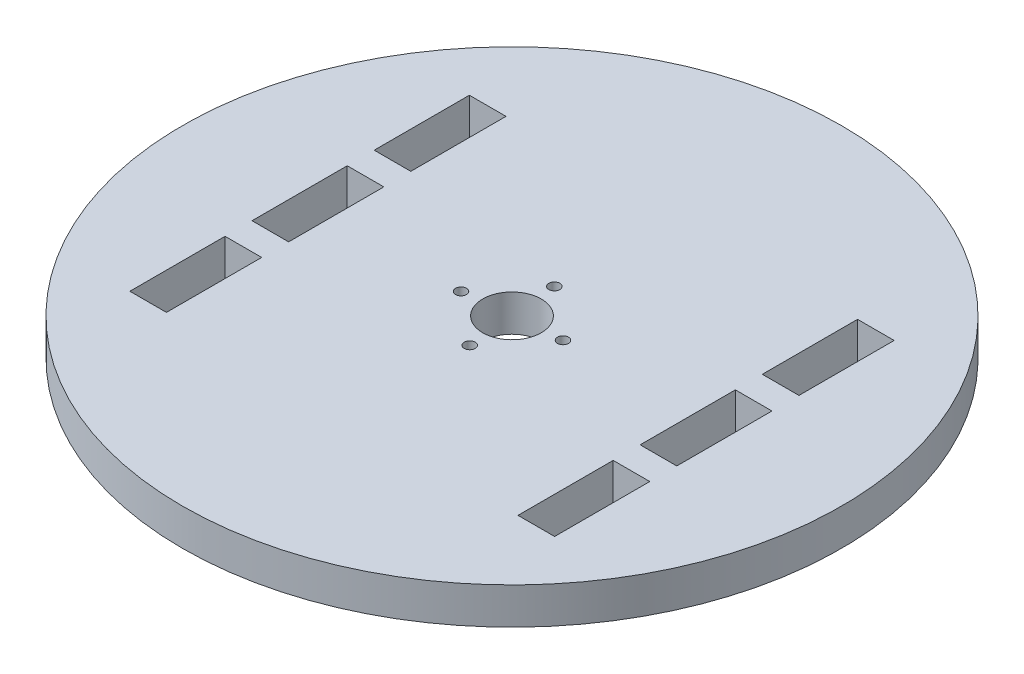
ISO-10303-21;
HEADER;
FILE_DESCRIPTION(('STEP AP214'),'2;1');
FILE_NAME('part.step','',(''),(''),'','','');
FILE_SCHEMA(('AUTOMOTIVE_DESIGN { 1 0 10303 214 1 1 1 1 }'));
ENDSEC;
DATA;
#1=APPLICATION_CONTEXT('core data for automotive mechanical design processes');
#2=APPLICATION_PROTOCOL_DEFINITION('international standard','automotive_design',2000,#1);
#3=PRODUCT_CONTEXT('',#1,'mechanical');
#4=PRODUCT('Part','Part','',(#3));
#5=PRODUCT_RELATED_PRODUCT_CATEGORY('part','',(#4));
#6=PRODUCT_DEFINITION_FORMATION('','',#4);
#7=PRODUCT_DEFINITION_CONTEXT('part definition',#1,'design');
#8=PRODUCT_DEFINITION('design','',#6,#7);
#9=PRODUCT_DEFINITION_SHAPE('','',#8);
#10=(LENGTH_UNIT() NAMED_UNIT(*) SI_UNIT(.MILLI.,.METRE.));
#11=(NAMED_UNIT(*) PLANE_ANGLE_UNIT() SI_UNIT($,.RADIAN.));
#12=(NAMED_UNIT(*) SI_UNIT($,.STERADIAN.) SOLID_ANGLE_UNIT());
#13=UNCERTAINTY_MEASURE_WITH_UNIT(LENGTH_MEASURE(1.E-05),#10,'distance_accuracy_value','');
#14=(GEOMETRIC_REPRESENTATION_CONTEXT(3) GLOBAL_UNCERTAINTY_ASSIGNED_CONTEXT((#13)) GLOBAL_UNIT_ASSIGNED_CONTEXT((#10,
#11,#12)) REPRESENTATION_CONTEXT('',''));
#15=CARTESIAN_POINT('',(0.,0.,0.));
#16=DIRECTION('',(0.,0.,1.));
#17=DIRECTION('',(1.,0.,0.));
#18=AXIS2_PLACEMENT_3D('',#15,#16,#17);
#19=CARTESIAN_POINT('',(0.,5.,0.));
#20=DIRECTION('',(0.,1.,0.));
#21=DIRECTION('',(0.,0.,1.));
#22=AXIS2_PLACEMENT_3D('',#19,#20,#21);
#23=PLANE('',#22);
#24=CARTESIAN_POINT('',(6.36892570362587,5.,-0.593189592894082));
#25=DIRECTION('',(0.,1.,0.));
#26=DIRECTION('',(0.,0.,1.));
#27=AXIS2_PLACEMENT_3D('',#24,#25,#26);
#28=CIRCLE('',#27,0.750000000000003);
#29=CARTESIAN_POINT('',(6.36892570362587,5.,0.156810407105921));
#30=VERTEX_POINT('',#29);
#31=EDGE_CURVE('E391',#30,#30,#28,.T.);
#32=ORIENTED_EDGE('',*,*,#31,.F.);
#33=EDGE_LOOP('',(#32));
#34=FACE_BOUND('',#33,.T.);
#35=CARTESIAN_POINT('',(0.593189592872379,5.,6.36892570362678));
#36=DIRECTION('',(0.,1.,0.));
#37=DIRECTION('',(0.,0.,1.));
#38=AXIS2_PLACEMENT_3D('',#35,#36,#37);
#39=CIRCLE('',#38,0.750000000000002);
#40=CARTESIAN_POINT('',(0.593189592872379,5.,7.11892570362678));
#41=VERTEX_POINT('',#40);
#42=EDGE_CURVE('E403',#41,#41,#39,.T.);
#43=ORIENTED_EDGE('',*,*,#42,.F.);
#44=EDGE_LOOP('',(#43));
#45=FACE_BOUND('',#44,.T.);
#46=CARTESIAN_POINT('',(0.,5.,0.));
#47=DIRECTION('',(0.,1.,0.));
#48=DIRECTION('',(0.,0.,1.));
#49=AXIS2_PLACEMENT_3D('',#46,#47,#48);
#50=CIRCLE('',#49,45.);
#51=CARTESIAN_POINT('',(0.,5.,45.));
#52=VERTEX_POINT('',#51);
#53=EDGE_CURVE('E11',#52,#52,#50,.T.);
#54=ORIENTED_EDGE('',*,*,#53,.T.);
#55=EDGE_LOOP('',(#54));
#56=FACE_BOUND('',#55,.T.);
#57=CARTESIAN_POINT('',(0.,5.,0.));
#58=DIRECTION('',(0.,1.,0.));
#59=DIRECTION('',(0.,0.,1.));
#60=AXIS2_PLACEMENT_3D('',#57,#58,#59);
#61=CIRCLE('',#60,4.);
#62=CARTESIAN_POINT('',(0.,5.,4.));
#63=VERTEX_POINT('',#62);
#64=EDGE_CURVE('E409',#63,#63,#61,.T.);
#65=ORIENTED_EDGE('',*,*,#64,.F.);
#66=EDGE_LOOP('',(#65));
#67=FACE_BOUND('',#66,.T.);
#68=CARTESIAN_POINT('',(-0.593189592895023,5.,-6.36892570364764));
#69=DIRECTION('',(0.,1.,0.));
#70=DIRECTION('',(0.,0.,1.));
#71=AXIS2_PLACEMENT_3D('',#68,#69,#70);
#72=CIRCLE('',#71,0.749999999999999);
#73=CARTESIAN_POINT('',(-0.593189592895023,5.,-5.61892570364764));
#74=VERTEX_POINT('',#73);
#75=EDGE_CURVE('E397',#74,#74,#72,.T.);
#76=ORIENTED_EDGE('',*,*,#75,.F.);
#77=EDGE_LOOP('',(#76));
#78=FACE_BOUND('',#77,.T.);
#79=CARTESIAN_POINT('',(-6.36892570364856,5.,0.593189592873272));
#80=DIRECTION('',(0.,1.,0.));
#81=DIRECTION('',(0.,0.,1.));
#82=AXIS2_PLACEMENT_3D('',#79,#80,#81);
#83=CIRCLE('',#82,0.749999999999999);
#84=CARTESIAN_POINT('',(-6.36892570364856,5.,1.34318959287327));
#85=VERTEX_POINT('',#84);
#86=EDGE_CURVE('E385',#85,#85,#83,.T.);
#87=ORIENTED_EDGE('',*,*,#86,.F.);
#88=EDGE_LOOP('',(#87));
#89=FACE_BOUND('',#88,.T.);
#90=DIRECTION('',(1.,0.,0.));
#91=VECTOR('',#90,1.);
#92=CARTESIAN_POINT('',(-29.,5.,23.1821344323739));
#93=LINE('',#92,#91);
#94=CARTESIAN_POINT('',(-29.,5.,23.1821344323739));
#95=VERTEX_POINT('',#94);
#96=CARTESIAN_POINT('',(-24.,5.,23.1821344323739));
#97=VERTEX_POINT('',#96);
#98=EDGE_CURVE('E356',#95,#97,#93,.T.);
#99=ORIENTED_EDGE('',*,*,#98,.F.);
#100=DIRECTION('',(0.,0.,1.));
#101=VECTOR('',#100,1.);
#102=CARTESIAN_POINT('',(-29.,5.,23.1821344323739));
#103=LINE('',#102,#101);
#104=CARTESIAN_POINT('',(-29.,5.,10.1821344323739));
#105=VERTEX_POINT('',#104);
#106=EDGE_CURVE('E354',#105,#95,#103,.T.);
#107=ORIENTED_EDGE('',*,*,#106,.F.);
#108=DIRECTION('',(-1.,0.,0.));
#109=VECTOR('',#108,1.);
#110=CARTESIAN_POINT('',(-24.,5.,10.1821344323739));
#111=LINE('',#110,#109);
#112=CARTESIAN_POINT('',(-24.,5.,10.1821344323739));
#113=VERTEX_POINT('',#112);
#114=EDGE_CURVE('E362',#113,#105,#111,.T.);
#115=ORIENTED_EDGE('',*,*,#114,.F.);
#116=DIRECTION('',(0.,0.,-1.));
#117=VECTOR('',#116,1.);
#118=CARTESIAN_POINT('',(-24.,5.,10.1821344323739));
#119=LINE('',#118,#117);
#120=EDGE_CURVE('E359',#97,#113,#119,.T.);
#121=ORIENTED_EDGE('',*,*,#120,.F.);
#122=EDGE_LOOP('',(#99,#107,#115,#121));
#123=FACE_BOUND('',#122,.T.);
#124=DIRECTION('',(0.,0.,-1.));
#125=VECTOR('',#124,1.);
#126=CARTESIAN_POINT('',(29.,5.,23.1821344323739));
#127=LINE('',#126,#125);
#128=CARTESIAN_POINT('',(29.,5.,23.1821344323739));
#129=VERTEX_POINT('',#128);
#130=CARTESIAN_POINT('',(29.,5.,10.1821344323739));
#131=VERTEX_POINT('',#130);
#132=EDGE_CURVE('E325',#129,#131,#127,.T.);
#133=ORIENTED_EDGE('',*,*,#132,.F.);
#134=DIRECTION('',(1.,0.,0.));
#135=VECTOR('',#134,1.);
#136=CARTESIAN_POINT('',(29.,5.,23.1821344323739));
#137=LINE('',#136,#135);
#138=CARTESIAN_POINT('',(24.,5.,23.1821344323739));
#139=VERTEX_POINT('',#138);
#140=EDGE_CURVE('E323',#139,#129,#137,.T.);
#141=ORIENTED_EDGE('',*,*,#140,.F.);
#142=DIRECTION('',(0.,0.,1.));
#143=VECTOR('',#142,1.);
#144=CARTESIAN_POINT('',(24.,5.,10.1821344323739));
#145=LINE('',#144,#143);
#146=CARTESIAN_POINT('',(24.,5.,10.1821344323739));
#147=VERTEX_POINT('',#146);
#148=EDGE_CURVE('E331',#147,#139,#145,.T.);
#149=ORIENTED_EDGE('',*,*,#148,.F.);
#150=DIRECTION('',(-1.,0.,0.));
#151=VECTOR('',#150,1.);
#152=CARTESIAN_POINT('',(24.,5.,10.1821344323739));
#153=LINE('',#152,#151);
#154=EDGE_CURVE('E328',#131,#147,#153,.T.);
#155=ORIENTED_EDGE('',*,*,#154,.F.);
#156=EDGE_LOOP('',(#133,#141,#149,#155));
#157=FACE_BOUND('',#156,.T.);
#158=DIRECTION('',(-1.,0.,0.));
#159=VECTOR('',#158,1.);
#160=CARTESIAN_POINT('',(29.,5.,-23.1821344323739));
#161=LINE('',#160,#159);
#162=CARTESIAN_POINT('',(29.,5.,-23.1821344323739));
#163=VERTEX_POINT('',#162);
#164=CARTESIAN_POINT('',(24.,5.,-23.1821344323739));
#165=VERTEX_POINT('',#164);
#166=EDGE_CURVE('E294',#163,#165,#161,.T.);
#167=ORIENTED_EDGE('',*,*,#166,.F.);
#168=DIRECTION('',(0.,0.,-1.));
#169=VECTOR('',#168,1.);
#170=CARTESIAN_POINT('',(29.,5.,-10.1821344323739));
#171=LINE('',#170,#169);
#172=CARTESIAN_POINT('',(29.,5.,-10.1821344323739));
#173=VERTEX_POINT('',#172);
#174=EDGE_CURVE('E292',#173,#163,#171,.T.);
#175=ORIENTED_EDGE('',*,*,#174,.F.);
#176=DIRECTION('',(1.,0.,0.));
#177=VECTOR('',#176,1.);
#178=CARTESIAN_POINT('',(24.,5.,-10.1821344323739));
#179=LINE('',#178,#177);
#180=CARTESIAN_POINT('',(24.,5.,-10.1821344323739));
#181=VERTEX_POINT('',#180);
#182=EDGE_CURVE('E300',#181,#173,#179,.T.);
#183=ORIENTED_EDGE('',*,*,#182,.F.);
#184=DIRECTION('',(0.,0.,1.));
#185=VECTOR('',#184,1.);
#186=CARTESIAN_POINT('',(24.,5.,-23.1821344323739));
#187=LINE('',#186,#185);
#188=EDGE_CURVE('E297',#165,#181,#187,.T.);
#189=ORIENTED_EDGE('',*,*,#188,.F.);
#190=EDGE_LOOP('',(#167,#175,#183,#189));
#191=FACE_BOUND('',#190,.T.);
#192=DIRECTION('',(1.,0.,0.));
#193=VECTOR('',#192,1.);
#194=CARTESIAN_POINT('',(24.,5.,6.5));
#195=LINE('',#194,#193);
#196=CARTESIAN_POINT('',(24.,5.,6.5));
#197=VERTEX_POINT('',#196);
#198=CARTESIAN_POINT('',(29.,5.,6.5));
#199=VERTEX_POINT('',#198);
#200=EDGE_CURVE('E263',#197,#199,#195,.T.);
#201=ORIENTED_EDGE('',*,*,#200,.F.);
#202=DIRECTION('',(0.,0.,1.));
#203=VECTOR('',#202,1.);
#204=CARTESIAN_POINT('',(24.,5.,-6.5));
#205=LINE('',#204,#203);
#206=CARTESIAN_POINT('',(24.,5.,-6.5));
#207=VERTEX_POINT('',#206);
#208=EDGE_CURVE('E261',#207,#197,#205,.T.);
#209=ORIENTED_EDGE('',*,*,#208,.F.);
#210=DIRECTION('',(-1.,0.,0.));
#211=VECTOR('',#210,1.);
#212=CARTESIAN_POINT('',(24.,5.,-6.5));
#213=LINE('',#212,#211);
#214=CARTESIAN_POINT('',(29.,5.,-6.5));
#215=VERTEX_POINT('',#214);
#216=EDGE_CURVE('E269',#215,#207,#213,.T.);
#217=ORIENTED_EDGE('',*,*,#216,.F.);
#218=DIRECTION('',(0.,0.,-1.));
#219=VECTOR('',#218,1.);
#220=CARTESIAN_POINT('',(29.,5.,6.5));
#221=LINE('',#220,#219);
#222=EDGE_CURVE('E266',#199,#215,#221,.T.);
#223=ORIENTED_EDGE('',*,*,#222,.F.);
#224=EDGE_LOOP('',(#201,#209,#217,#223));
#225=FACE_BOUND('',#224,.T.);
#226=DIRECTION('',(-1.,0.,0.));
#227=VECTOR('',#226,1.);
#228=CARTESIAN_POINT('',(-24.,5.,-6.50000000000001));
#229=LINE('',#228,#227);
#230=CARTESIAN_POINT('',(-24.,5.,-6.50000000000001));
#231=VERTEX_POINT('',#230);
#232=CARTESIAN_POINT('',(-29.,5.,-6.49999999999999));
#233=VERTEX_POINT('',#232);
#234=EDGE_CURVE('E232',#231,#233,#229,.T.);
#235=ORIENTED_EDGE('',*,*,#234,.F.);
#236=DIRECTION('',(0.,0.,-1.));
#237=VECTOR('',#236,1.);
#238=CARTESIAN_POINT('',(-24.,5.,-6.50000000000001));
#239=LINE('',#238,#237);
#240=CARTESIAN_POINT('',(-24.,5.,6.50000000000001));
#241=VERTEX_POINT('',#240);
#242=EDGE_CURVE('E230',#241,#231,#239,.T.);
#243=ORIENTED_EDGE('',*,*,#242,.F.);
#244=DIRECTION('',(1.,0.,0.));
#245=VECTOR('',#244,1.);
#246=CARTESIAN_POINT('',(-24.,5.,6.50000000000001));
#247=LINE('',#246,#245);
#248=CARTESIAN_POINT('',(-29.,5.,6.49999999999999));
#249=VERTEX_POINT('',#248);
#250=EDGE_CURVE('E238',#249,#241,#247,.T.);
#251=ORIENTED_EDGE('',*,*,#250,.F.);
#252=DIRECTION('',(0.,0.,1.));
#253=VECTOR('',#252,1.);
#254=CARTESIAN_POINT('',(-29.,5.,6.49999999999999));
#255=LINE('',#254,#253);
#256=EDGE_CURVE('E235',#233,#249,#255,.T.);
#257=ORIENTED_EDGE('',*,*,#256,.F.);
#258=EDGE_LOOP('',(#235,#243,#251,#257));
#259=FACE_BOUND('',#258,.T.);
#260=DIRECTION('',(-1.,0.,0.));
#261=VECTOR('',#260,1.);
#262=CARTESIAN_POINT('',(-29.,5.,-23.1821344323739));
#263=LINE('',#262,#261);
#264=CARTESIAN_POINT('',(-24.,5.,-23.1821344323739));
#265=VERTEX_POINT('',#264);
#266=CARTESIAN_POINT('',(-29.,5.,-23.1821344323739));
#267=VERTEX_POINT('',#266);
#268=EDGE_CURVE('E202',#265,#267,#263,.T.);
#269=ORIENTED_EDGE('',*,*,#268,.F.);
#270=DIRECTION('',(0.,0.,-1.));
#271=VECTOR('',#270,1.);
#272=CARTESIAN_POINT('',(-24.,5.,-23.1821344323739));
#273=LINE('',#272,#271);
#274=CARTESIAN_POINT('',(-24.,5.,-10.1821344323739));
#275=VERTEX_POINT('',#274);
#276=EDGE_CURVE('E194',#275,#265,#273,.T.);
#277=ORIENTED_EDGE('',*,*,#276,.F.);
#278=DIRECTION('',(1.,0.,0.));
#279=VECTOR('',#278,1.);
#280=CARTESIAN_POINT('',(-24.,5.,-10.1821344323739));
#281=LINE('',#280,#279);
#282=CARTESIAN_POINT('',(-29.,5.,-10.1821344323739));
#283=VERTEX_POINT('',#282);
#284=EDGE_CURVE('E216',#283,#275,#281,.T.);
#285=ORIENTED_EDGE('',*,*,#284,.F.);
#286=DIRECTION('',(0.,0.,1.));
#287=VECTOR('',#286,1.);
#288=CARTESIAN_POINT('',(-29.,5.,-10.1821344323739));
#289=LINE('',#288,#287);
#290=EDGE_CURVE('E214',#267,#283,#289,.T.);
#291=ORIENTED_EDGE('',*,*,#290,.F.);
#292=EDGE_LOOP('',(#269,#277,#285,#291));
#293=FACE_BOUND('',#292,.T.);
#294=ADVANCED_FACE('F33',(#34,#45,#56,#67,#78,#89,#123,#157,#191,#225,#259,#293),#23,.T.);
#295=CARTESIAN_POINT('',(0.,0.,0.));
#296=DIRECTION('',(0.,1.,0.));
#297=DIRECTION('',(0.,0.,1.));
#298=AXIS2_PLACEMENT_3D('',#295,#296,#297);
#299=PLANE('',#298);
#300=DIRECTION('',(0.,0.,-1.));
#301=VECTOR('',#300,1.);
#302=CARTESIAN_POINT('',(-24.,0.,-6.50000000000001));
#303=LINE('',#302,#301);
#304=CARTESIAN_POINT('',(-24.,0.,6.50000000000001));
#305=VERTEX_POINT('',#304);
#306=CARTESIAN_POINT('',(-24.,0.,-6.50000000000001));
#307=VERTEX_POINT('',#306);
#308=EDGE_CURVE('E210',#305,#307,#303,.T.);
#309=ORIENTED_EDGE('',*,*,#308,.T.);
#310=DIRECTION('',(-1.,0.,0.));
#311=VECTOR('',#310,1.);
#312=CARTESIAN_POINT('',(-24.,0.,-6.50000000000001));
#313=LINE('',#312,#311);
#314=CARTESIAN_POINT('',(-29.,0.,-6.49999999999999));
#315=VERTEX_POINT('',#314);
#316=EDGE_CURVE('E243',#307,#315,#313,.T.);
#317=ORIENTED_EDGE('',*,*,#316,.T.);
#318=DIRECTION('',(0.,0.,1.));
#319=VECTOR('',#318,1.);
#320=CARTESIAN_POINT('',(-29.,0.,6.49999999999999));
#321=LINE('',#320,#319);
#322=CARTESIAN_POINT('',(-29.,0.,6.49999999999999));
#323=VERTEX_POINT('',#322);
#324=EDGE_CURVE('E246',#315,#323,#321,.T.);
#325=ORIENTED_EDGE('',*,*,#324,.T.);
#326=DIRECTION('',(1.,0.,0.));
#327=VECTOR('',#326,1.);
#328=CARTESIAN_POINT('',(-24.,0.,6.50000000000001));
#329=LINE('',#328,#327);
#330=EDGE_CURVE('E233',#323,#305,#329,.T.);
#331=ORIENTED_EDGE('',*,*,#330,.T.);
#332=EDGE_LOOP('',(#309,#317,#325,#331));
#333=FACE_BOUND('',#332,.T.);
#334=DIRECTION('',(0.,0.,-1.));
#335=VECTOR('',#334,1.);
#336=CARTESIAN_POINT('',(29.,0.,-10.1821344323739));
#337=LINE('',#336,#335);
#338=CARTESIAN_POINT('',(29.,0.,-10.1821344323739));
#339=VERTEX_POINT('',#338);
#340=CARTESIAN_POINT('',(29.,0.,-23.1821344323739));
#341=VERTEX_POINT('',#340);
#342=EDGE_CURVE('E291',#339,#341,#337,.T.);
#343=ORIENTED_EDGE('',*,*,#342,.T.);
#344=DIRECTION('',(-1.,0.,0.));
#345=VECTOR('',#344,1.);
#346=CARTESIAN_POINT('',(29.,0.,-23.1821344323739));
#347=LINE('',#346,#345);
#348=CARTESIAN_POINT('',(24.,0.,-23.1821344323739));
#349=VERTEX_POINT('',#348);
#350=EDGE_CURVE('E305',#341,#349,#347,.T.);
#351=ORIENTED_EDGE('',*,*,#350,.T.);
#352=DIRECTION('',(0.,0.,1.));
#353=VECTOR('',#352,1.);
#354=CARTESIAN_POINT('',(24.,0.,-23.1821344323739));
#355=LINE('',#354,#353);
#356=CARTESIAN_POINT('',(24.,0.,-10.1821344323739));
#357=VERTEX_POINT('',#356);
#358=EDGE_CURVE('E308',#349,#357,#355,.T.);
#359=ORIENTED_EDGE('',*,*,#358,.T.);
#360=DIRECTION('',(1.,0.,0.));
#361=VECTOR('',#360,1.);
#362=CARTESIAN_POINT('',(24.,0.,-10.1821344323739));
#363=LINE('',#362,#361);
#364=EDGE_CURVE('E295',#357,#339,#363,.T.);
#365=ORIENTED_EDGE('',*,*,#364,.T.);
#366=EDGE_LOOP('',(#343,#351,#359,#365));
#367=FACE_BOUND('',#366,.T.);
#368=DIRECTION('',(0.,0.,1.));
#369=VECTOR('',#368,1.);
#370=CARTESIAN_POINT('',(-29.,0.,23.1821344323739));
#371=LINE('',#370,#369);
#372=CARTESIAN_POINT('',(-29.,0.,10.1821344323739));
#373=VERTEX_POINT('',#372);
#374=CARTESIAN_POINT('',(-29.,0.,23.1821344323739));
#375=VERTEX_POINT('',#374);
#376=EDGE_CURVE('E353',#373,#375,#371,.T.);
#377=ORIENTED_EDGE('',*,*,#376,.T.);
#378=DIRECTION('',(1.,0.,0.));
#379=VECTOR('',#378,1.);
#380=CARTESIAN_POINT('',(-29.,0.,23.1821344323739));
#381=LINE('',#380,#379);
#382=CARTESIAN_POINT('',(-24.,0.,23.1821344323739));
#383=VERTEX_POINT('',#382);
#384=EDGE_CURVE('E367',#375,#383,#381,.T.);
#385=ORIENTED_EDGE('',*,*,#384,.T.);
#386=DIRECTION('',(0.,0.,-1.));
#387=VECTOR('',#386,1.);
#388=CARTESIAN_POINT('',(-24.,0.,10.1821344323739));
#389=LINE('',#388,#387);
#390=CARTESIAN_POINT('',(-24.,0.,10.1821344323739));
#391=VERTEX_POINT('',#390);
#392=EDGE_CURVE('E370',#383,#391,#389,.T.);
#393=ORIENTED_EDGE('',*,*,#392,.T.);
#394=DIRECTION('',(-1.,0.,0.));
#395=VECTOR('',#394,1.);
#396=CARTESIAN_POINT('',(-24.,0.,10.1821344323739));
#397=LINE('',#396,#395);
#398=EDGE_CURVE('E357',#391,#373,#397,.T.);
#399=ORIENTED_EDGE('',*,*,#398,.T.);
#400=EDGE_LOOP('',(#377,#385,#393,#399));
#401=FACE_BOUND('',#400,.T.);
#402=CARTESIAN_POINT('',(0.,0.,0.));
#403=DIRECTION('',(0.,1.,0.));
#404=DIRECTION('',(0.,0.,1.));
#405=AXIS2_PLACEMENT_3D('',#402,#403,#404);
#406=CIRCLE('',#405,45.);
#407=CARTESIAN_POINT('',(0.,0.,45.));
#408=VERTEX_POINT('',#407);
#409=EDGE_CURVE('E37',#408,#408,#406,.T.);
#410=ORIENTED_EDGE('',*,*,#409,.F.);
#411=EDGE_LOOP('',(#410));
#412=FACE_BOUND('',#411,.T.);
#413=CARTESIAN_POINT('',(0.,0.,0.));
#414=DIRECTION('',(0.,1.,0.));
#415=DIRECTION('',(0.,0.,1.));
#416=AXIS2_PLACEMENT_3D('',#413,#414,#415);
#417=CIRCLE('',#416,4.);
#418=CARTESIAN_POINT('',(0.,0.,4.));
#419=VERTEX_POINT('',#418);
#420=EDGE_CURVE('E406',#419,#419,#417,.T.);
#421=ORIENTED_EDGE('',*,*,#420,.T.);
#422=EDGE_LOOP('',(#421));
#423=FACE_BOUND('',#422,.T.);
#424=CARTESIAN_POINT('',(0.593189592872379,0.,6.36892570362678));
#425=DIRECTION('',(0.,1.,0.));
#426=DIRECTION('',(0.,0.,1.));
#427=AXIS2_PLACEMENT_3D('',#424,#425,#426);
#428=CIRCLE('',#427,0.750000000000002);
#429=CARTESIAN_POINT('',(0.593189592872379,0.,7.11892570362678));
#430=VERTEX_POINT('',#429);
#431=EDGE_CURVE('E400',#430,#430,#428,.T.);
#432=ORIENTED_EDGE('',*,*,#431,.T.);
#433=EDGE_LOOP('',(#432));
#434=FACE_BOUND('',#433,.T.);
#435=CARTESIAN_POINT('',(-0.593189592895023,0.,-6.36892570364764));
#436=DIRECTION('',(0.,1.,0.));
#437=DIRECTION('',(0.,0.,1.));
#438=AXIS2_PLACEMENT_3D('',#435,#436,#437);
#439=CIRCLE('',#438,0.749999999999999);
#440=CARTESIAN_POINT('',(-0.593189592895023,0.,-5.61892570364764));
#441=VERTEX_POINT('',#440);
#442=EDGE_CURVE('E394',#441,#441,#439,.T.);
#443=ORIENTED_EDGE('',*,*,#442,.T.);
#444=EDGE_LOOP('',(#443));
#445=FACE_BOUND('',#444,.T.);
#446=CARTESIAN_POINT('',(6.36892570362587,0.,-0.593189592894082));
#447=DIRECTION('',(0.,1.,0.));
#448=DIRECTION('',(0.,0.,1.));
#449=AXIS2_PLACEMENT_3D('',#446,#447,#448);
#450=CIRCLE('',#449,0.750000000000003);
#451=CARTESIAN_POINT('',(6.36892570362587,0.,0.156810407105921));
#452=VERTEX_POINT('',#451);
#453=EDGE_CURVE('E388',#452,#452,#450,.T.);
#454=ORIENTED_EDGE('',*,*,#453,.T.);
#455=EDGE_LOOP('',(#454));
#456=FACE_BOUND('',#455,.T.);
#457=CARTESIAN_POINT('',(-6.36892570364856,0.,0.593189592873272));
#458=DIRECTION('',(0.,1.,0.));
#459=DIRECTION('',(0.,0.,1.));
#460=AXIS2_PLACEMENT_3D('',#457,#458,#459);
#461=CIRCLE('',#460,0.749999999999999);
#462=CARTESIAN_POINT('',(-6.36892570364856,0.,1.34318959287327));
#463=VERTEX_POINT('',#462);
#464=EDGE_CURVE('E384',#463,#463,#461,.T.);
#465=ORIENTED_EDGE('',*,*,#464,.T.);
#466=EDGE_LOOP('',(#465));
#467=FACE_BOUND('',#466,.T.);
#468=DIRECTION('',(1.,0.,0.));
#469=VECTOR('',#468,1.);
#470=CARTESIAN_POINT('',(29.,0.,23.1821344323739));
#471=LINE('',#470,#469);
#472=CARTESIAN_POINT('',(24.,0.,23.1821344323739));
#473=VERTEX_POINT('',#472);
#474=CARTESIAN_POINT('',(29.,0.,23.1821344323739));
#475=VERTEX_POINT('',#474);
#476=EDGE_CURVE('E322',#473,#475,#471,.T.);
#477=ORIENTED_EDGE('',*,*,#476,.T.);
#478=DIRECTION('',(0.,0.,-1.));
#479=VECTOR('',#478,1.);
#480=CARTESIAN_POINT('',(29.,0.,23.1821344323739));
#481=LINE('',#480,#479);
#482=CARTESIAN_POINT('',(29.,0.,10.1821344323739));
#483=VERTEX_POINT('',#482);
#484=EDGE_CURVE('E336',#475,#483,#481,.T.);
#485=ORIENTED_EDGE('',*,*,#484,.T.);
#486=DIRECTION('',(-1.,0.,0.));
#487=VECTOR('',#486,1.);
#488=CARTESIAN_POINT('',(24.,0.,10.1821344323739));
#489=LINE('',#488,#487);
#490=CARTESIAN_POINT('',(24.,0.,10.1821344323739));
#491=VERTEX_POINT('',#490);
#492=EDGE_CURVE('E339',#483,#491,#489,.T.);
#493=ORIENTED_EDGE('',*,*,#492,.T.);
#494=DIRECTION('',(0.,0.,1.));
#495=VECTOR('',#494,1.);
#496=CARTESIAN_POINT('',(24.,0.,10.1821344323739));
#497=LINE('',#496,#495);
#498=EDGE_CURVE('E326',#491,#473,#497,.T.);
#499=ORIENTED_EDGE('',*,*,#498,.T.);
#500=EDGE_LOOP('',(#477,#485,#493,#499));
#501=FACE_BOUND('',#500,.T.);
#502=DIRECTION('',(0.,0.,1.));
#503=VECTOR('',#502,1.);
#504=CARTESIAN_POINT('',(24.,0.,-6.5));
#505=LINE('',#504,#503);
#506=CARTESIAN_POINT('',(24.,0.,-6.5));
#507=VERTEX_POINT('',#506);
#508=CARTESIAN_POINT('',(24.,0.,6.5));
#509=VERTEX_POINT('',#508);
#510=EDGE_CURVE('E260',#507,#509,#505,.T.);
#511=ORIENTED_EDGE('',*,*,#510,.T.);
#512=DIRECTION('',(1.,0.,0.));
#513=VECTOR('',#512,1.);
#514=CARTESIAN_POINT('',(24.,0.,6.5));
#515=LINE('',#514,#513);
#516=CARTESIAN_POINT('',(29.,0.,6.5));
#517=VERTEX_POINT('',#516);
#518=EDGE_CURVE('E274',#509,#517,#515,.T.);
#519=ORIENTED_EDGE('',*,*,#518,.T.);
#520=DIRECTION('',(0.,0.,-1.));
#521=VECTOR('',#520,1.);
#522=CARTESIAN_POINT('',(29.,0.,6.5));
#523=LINE('',#522,#521);
#524=CARTESIAN_POINT('',(29.,0.,-6.5));
#525=VERTEX_POINT('',#524);
#526=EDGE_CURVE('E277',#517,#525,#523,.T.);
#527=ORIENTED_EDGE('',*,*,#526,.T.);
#528=DIRECTION('',(-1.,0.,0.));
#529=VECTOR('',#528,1.);
#530=CARTESIAN_POINT('',(24.,0.,-6.5));
#531=LINE('',#530,#529);
#532=EDGE_CURVE('E264',#525,#507,#531,.T.);
#533=ORIENTED_EDGE('',*,*,#532,.T.);
#534=EDGE_LOOP('',(#511,#519,#527,#533));
#535=FACE_BOUND('',#534,.T.);
#536=DIRECTION('',(0.,0.,-1.));
#537=VECTOR('',#536,1.);
#538=CARTESIAN_POINT('',(-24.,0.,-23.1821344323739));
#539=LINE('',#538,#537);
#540=CARTESIAN_POINT('',(-24.,0.,-10.1821344323739));
#541=VERTEX_POINT('',#540);
#542=CARTESIAN_POINT('',(-24.,0.,-23.1821344323739));
#543=VERTEX_POINT('',#542);
#544=EDGE_CURVE('E56',#541,#543,#539,.T.);
#545=ORIENTED_EDGE('',*,*,#544,.T.);
#546=DIRECTION('',(-1.,0.,0.));
#547=VECTOR('',#546,1.);
#548=CARTESIAN_POINT('',(-29.,0.,-23.1821344323739));
#549=LINE('',#548,#547);
#550=CARTESIAN_POINT('',(-29.,0.,-23.1821344323739));
#551=VERTEX_POINT('',#550);
#552=EDGE_CURVE('E209',#543,#551,#549,.T.);
#553=ORIENTED_EDGE('',*,*,#552,.T.);
#554=DIRECTION('',(0.,0.,1.));
#555=VECTOR('',#554,1.);
#556=CARTESIAN_POINT('',(-29.,0.,-10.1821344323739));
#557=LINE('',#556,#555);
#558=CARTESIAN_POINT('',(-29.,0.,-10.1821344323739));
#559=VERTEX_POINT('',#558);
#560=EDGE_CURVE('E222',#551,#559,#557,.T.);
#561=ORIENTED_EDGE('',*,*,#560,.T.);
#562=DIRECTION('',(1.,0.,0.));
#563=VECTOR('',#562,1.);
#564=CARTESIAN_POINT('',(-24.,0.,-10.1821344323739));
#565=LINE('',#564,#563);
#566=EDGE_CURVE('E203',#559,#541,#565,.T.);
#567=ORIENTED_EDGE('',*,*,#566,.T.);
#568=EDGE_LOOP('',(#545,#553,#561,#567));
#569=FACE_BOUND('',#568,.T.);
#570=ADVANCED_FACE('F415',(#333,#367,#401,#412,#423,#434,#445,#456,#467,#501,#535,#569),#299,.F.);
#571=CARTESIAN_POINT('',(0.,5.,0.));
#572=DIRECTION('',(0.,-1.,0.));
#573=DIRECTION('',(0.,0.,-1.));
#574=AXIS2_PLACEMENT_3D('',#571,#572,#573);
#575=CYLINDRICAL_SURFACE('',#574,45.);
#576=ORIENTED_EDGE('',*,*,#53,.F.);
#577=EDGE_LOOP('',(#576));
#578=FACE_BOUND('',#577,.T.);
#579=ORIENTED_EDGE('',*,*,#409,.T.);
#580=EDGE_LOOP('',(#579));
#581=FACE_BOUND('',#580,.T.);
#582=ADVANCED_FACE('F35',(#578,#581),#575,.T.);
#583=CARTESIAN_POINT('',(0.,5.,0.));
#584=DIRECTION('',(0.,-1.,0.));
#585=DIRECTION('',(0.,0.,-1.));
#586=AXIS2_PLACEMENT_3D('',#583,#584,#585);
#587=CYLINDRICAL_SURFACE('',#586,4.);
#588=ORIENTED_EDGE('',*,*,#64,.T.);
#589=EDGE_LOOP('',(#588));
#590=FACE_BOUND('',#589,.T.);
#591=ORIENTED_EDGE('',*,*,#420,.F.);
#592=EDGE_LOOP('',(#591));
#593=FACE_BOUND('',#592,.T.);
#594=ADVANCED_FACE('F418',(#590,#593),#587,.F.);
#595=CARTESIAN_POINT('',(0.593189592872379,5.,6.36892570362678));
#596=DIRECTION('',(0.,-1.,0.));
#597=DIRECTION('',(0.,0.,-1.));
#598=AXIS2_PLACEMENT_3D('',#595,#596,#597);
#599=CYLINDRICAL_SURFACE('',#598,0.750000000000002);
#600=ORIENTED_EDGE('',*,*,#42,.T.);
#601=EDGE_LOOP('',(#600));
#602=FACE_BOUND('',#601,.T.);
#603=ORIENTED_EDGE('',*,*,#431,.F.);
#604=EDGE_LOOP('',(#603));
#605=FACE_BOUND('',#604,.T.);
#606=ADVANCED_FACE('F420',(#602,#605),#599,.F.);
#607=CARTESIAN_POINT('',(-0.593189592895023,5.,-6.36892570364764));
#608=DIRECTION('',(0.,-1.,0.));
#609=DIRECTION('',(0.,0.,-1.));
#610=AXIS2_PLACEMENT_3D('',#607,#608,#609);
#611=CYLINDRICAL_SURFACE('',#610,0.749999999999999);
#612=ORIENTED_EDGE('',*,*,#75,.T.);
#613=EDGE_LOOP('',(#612));
#614=FACE_BOUND('',#613,.T.);
#615=ORIENTED_EDGE('',*,*,#442,.F.);
#616=EDGE_LOOP('',(#615));
#617=FACE_BOUND('',#616,.T.);
#618=ADVANCED_FACE('F427',(#614,#617),#611,.F.);
#619=CARTESIAN_POINT('',(6.36892570362587,5.,-0.593189592894082));
#620=DIRECTION('',(0.,-1.,0.));
#621=DIRECTION('',(0.,0.,-1.));
#622=AXIS2_PLACEMENT_3D('',#619,#620,#621);
#623=CYLINDRICAL_SURFACE('',#622,0.750000000000003);
#624=ORIENTED_EDGE('',*,*,#31,.T.);
#625=EDGE_LOOP('',(#624));
#626=FACE_BOUND('',#625,.T.);
#627=ORIENTED_EDGE('',*,*,#453,.F.);
#628=EDGE_LOOP('',(#627));
#629=FACE_BOUND('',#628,.T.);
#630=ADVANCED_FACE('F565',(#626,#629),#623,.F.);
#631=CARTESIAN_POINT('',(-6.36892570364856,5.,0.593189592873272));
#632=DIRECTION('',(0.,-1.,0.));
#633=DIRECTION('',(0.,0.,-1.));
#634=AXIS2_PLACEMENT_3D('',#631,#632,#633);
#635=CYLINDRICAL_SURFACE('',#634,0.749999999999999);
#636=ORIENTED_EDGE('',*,*,#86,.T.);
#637=EDGE_LOOP('',(#636));
#638=FACE_BOUND('',#637,.T.);
#639=ORIENTED_EDGE('',*,*,#464,.F.);
#640=EDGE_LOOP('',(#639));
#641=FACE_BOUND('',#640,.T.);
#642=ADVANCED_FACE('F561',(#638,#641),#635,.F.);
#643=CARTESIAN_POINT('',(-29.,5.,23.1821344323739));
#644=DIRECTION('',(1.,0.,0.));
#645=DIRECTION('',(0.,0.,-1.));
#646=AXIS2_PLACEMENT_3D('',#643,#644,#645);
#647=PLANE('',#646);
#648=ORIENTED_EDGE('',*,*,#376,.F.);
#649=DIRECTION('',(0.,-1.,0.));
#650=VECTOR('',#649,1.);
#651=CARTESIAN_POINT('',(-29.,5.,10.1821344323739));
#652=LINE('',#651,#650);
#653=EDGE_CURVE('E364',#105,#373,#652,.T.);
#654=ORIENTED_EDGE('',*,*,#653,.F.);
#655=ORIENTED_EDGE('',*,*,#106,.T.);
#656=DIRECTION('',(0.,-1.,0.));
#657=VECTOR('',#656,1.);
#658=CARTESIAN_POINT('',(-29.,5.,23.1821344323739));
#659=LINE('',#658,#657);
#660=EDGE_CURVE('E381',#95,#375,#659,.T.);
#661=ORIENTED_EDGE('',*,*,#660,.T.);
#662=EDGE_LOOP('',(#648,#654,#655,#661));
#663=FACE_BOUND('',#662,.T.);
#664=ADVANCED_FACE('F557',(#663),#647,.T.);
#665=CARTESIAN_POINT('',(-29.,5.,23.1821344323739));
#666=DIRECTION('',(0.,0.,-1.));
#667=DIRECTION('',(-1.,0.,0.));
#668=AXIS2_PLACEMENT_3D('',#665,#666,#667);
#669=PLANE('',#668);
#670=ORIENTED_EDGE('',*,*,#384,.F.);
#671=ORIENTED_EDGE('',*,*,#660,.F.);
#672=ORIENTED_EDGE('',*,*,#98,.T.);
#673=DIRECTION('',(0.,-1.,0.));
#674=VECTOR('',#673,1.);
#675=CARTESIAN_POINT('',(-24.,5.,23.1821344323739));
#676=LINE('',#675,#674);
#677=EDGE_CURVE('E379',#97,#383,#676,.T.);
#678=ORIENTED_EDGE('',*,*,#677,.T.);
#679=EDGE_LOOP('',(#670,#671,#672,#678));
#680=FACE_BOUND('',#679,.T.);
#681=ADVANCED_FACE('F553',(#680),#669,.T.);
#682=CARTESIAN_POINT('',(-24.,5.,10.1821344323739));
#683=DIRECTION('',(-1.,0.,0.));
#684=DIRECTION('',(0.,0.,1.));
#685=AXIS2_PLACEMENT_3D('',#682,#683,#684);
#686=PLANE('',#685);
#687=ORIENTED_EDGE('',*,*,#392,.F.);
#688=ORIENTED_EDGE('',*,*,#677,.F.);
#689=ORIENTED_EDGE('',*,*,#120,.T.);
#690=DIRECTION('',(0.,-1.,0.));
#691=VECTOR('',#690,1.);
#692=CARTESIAN_POINT('',(-24.,5.,10.1821344323739));
#693=LINE('',#692,#691);
#694=EDGE_CURVE('E377',#113,#391,#693,.T.);
#695=ORIENTED_EDGE('',*,*,#694,.T.);
#696=EDGE_LOOP('',(#687,#688,#689,#695));
#697=FACE_BOUND('',#696,.T.);
#698=ADVANCED_FACE('F549',(#697),#686,.T.);
#699=CARTESIAN_POINT('',(-24.,5.,10.1821344323739));
#700=DIRECTION('',(0.,0.,1.));
#701=DIRECTION('',(1.,0.,0.));
#702=AXIS2_PLACEMENT_3D('',#699,#700,#701);
#703=PLANE('',#702);
#704=ORIENTED_EDGE('',*,*,#398,.F.);
#705=ORIENTED_EDGE('',*,*,#694,.F.);
#706=ORIENTED_EDGE('',*,*,#114,.T.);
#707=ORIENTED_EDGE('',*,*,#653,.T.);
#708=EDGE_LOOP('',(#704,#705,#706,#707));
#709=FACE_BOUND('',#708,.T.);
#710=ADVANCED_FACE('F545',(#709),#703,.T.);
#711=CARTESIAN_POINT('',(29.,5.,23.1821344323739));
#712=DIRECTION('',(0.,0.,-1.));
#713=DIRECTION('',(-1.,0.,0.));
#714=AXIS2_PLACEMENT_3D('',#711,#712,#713);
#715=PLANE('',#714);
#716=ORIENTED_EDGE('',*,*,#476,.F.);
#717=DIRECTION('',(0.,-1.,0.));
#718=VECTOR('',#717,1.);
#719=CARTESIAN_POINT('',(24.,5.,23.1821344323739));
#720=LINE('',#719,#718);
#721=EDGE_CURVE('E333',#139,#473,#720,.T.);
#722=ORIENTED_EDGE('',*,*,#721,.F.);
#723=ORIENTED_EDGE('',*,*,#140,.T.);
#724=DIRECTION('',(0.,-1.,0.));
#725=VECTOR('',#724,1.);
#726=CARTESIAN_POINT('',(29.,5.,23.1821344323739));
#727=LINE('',#726,#725);
#728=EDGE_CURVE('E350',#129,#475,#727,.T.);
#729=ORIENTED_EDGE('',*,*,#728,.T.);
#730=EDGE_LOOP('',(#716,#722,#723,#729));
#731=FACE_BOUND('',#730,.T.);
#732=ADVANCED_FACE('F541',(#731),#715,.T.);
#733=CARTESIAN_POINT('',(29.,5.,23.1821344323739));
#734=DIRECTION('',(-1.,0.,0.));
#735=DIRECTION('',(0.,0.,1.));
#736=AXIS2_PLACEMENT_3D('',#733,#734,#735);
#737=PLANE('',#736);
#738=ORIENTED_EDGE('',*,*,#484,.F.);
#739=ORIENTED_EDGE('',*,*,#728,.F.);
#740=ORIENTED_EDGE('',*,*,#132,.T.);
#741=DIRECTION('',(0.,-1.,0.));
#742=VECTOR('',#741,1.);
#743=CARTESIAN_POINT('',(29.,5.,10.1821344323739));
#744=LINE('',#743,#742);
#745=EDGE_CURVE('E348',#131,#483,#744,.T.);
#746=ORIENTED_EDGE('',*,*,#745,.T.);
#747=EDGE_LOOP('',(#738,#739,#740,#746));
#748=FACE_BOUND('',#747,.T.);
#749=ADVANCED_FACE('F537',(#748),#737,.T.);
#750=CARTESIAN_POINT('',(24.,5.,10.1821344323739));
#751=DIRECTION('',(0.,0.,1.));
#752=DIRECTION('',(1.,0.,0.));
#753=AXIS2_PLACEMENT_3D('',#750,#751,#752);
#754=PLANE('',#753);
#755=ORIENTED_EDGE('',*,*,#492,.F.);
#756=ORIENTED_EDGE('',*,*,#745,.F.);
#757=ORIENTED_EDGE('',*,*,#154,.T.);
#758=DIRECTION('',(0.,-1.,0.));
#759=VECTOR('',#758,1.);
#760=CARTESIAN_POINT('',(24.,5.,10.1821344323739));
#761=LINE('',#760,#759);
#762=EDGE_CURVE('E346',#147,#491,#761,.T.);
#763=ORIENTED_EDGE('',*,*,#762,.T.);
#764=EDGE_LOOP('',(#755,#756,#757,#763));
#765=FACE_BOUND('',#764,.T.);
#766=ADVANCED_FACE('F533',(#765),#754,.T.);
#767=CARTESIAN_POINT('',(24.,5.,10.1821344323739));
#768=DIRECTION('',(1.,0.,0.));
#769=DIRECTION('',(0.,0.,-1.));
#770=AXIS2_PLACEMENT_3D('',#767,#768,#769);
#771=PLANE('',#770);
#772=ORIENTED_EDGE('',*,*,#498,.F.);
#773=ORIENTED_EDGE('',*,*,#762,.F.);
#774=ORIENTED_EDGE('',*,*,#148,.T.);
#775=ORIENTED_EDGE('',*,*,#721,.T.);
#776=EDGE_LOOP('',(#772,#773,#774,#775));
#777=FACE_BOUND('',#776,.T.);
#778=ADVANCED_FACE('F529',(#777),#771,.T.);
#779=CARTESIAN_POINT('',(29.,5.,-10.1821344323739));
#780=DIRECTION('',(-1.,0.,0.));
#781=DIRECTION('',(0.,0.,1.));
#782=AXIS2_PLACEMENT_3D('',#779,#780,#781);
#783=PLANE('',#782);
#784=ORIENTED_EDGE('',*,*,#342,.F.);
#785=DIRECTION('',(0.,-1.,0.));
#786=VECTOR('',#785,1.);
#787=CARTESIAN_POINT('',(29.,5.,-10.1821344323739));
#788=LINE('',#787,#786);
#789=EDGE_CURVE('E302',#173,#339,#788,.T.);
#790=ORIENTED_EDGE('',*,*,#789,.F.);
#791=ORIENTED_EDGE('',*,*,#174,.T.);
#792=DIRECTION('',(0.,-1.,0.));
#793=VECTOR('',#792,1.);
#794=CARTESIAN_POINT('',(29.,5.,-23.1821344323739));
#795=LINE('',#794,#793);
#796=EDGE_CURVE('E319',#163,#341,#795,.T.);
#797=ORIENTED_EDGE('',*,*,#796,.T.);
#798=EDGE_LOOP('',(#784,#790,#791,#797));
#799=FACE_BOUND('',#798,.T.);
#800=ADVANCED_FACE('F525',(#799),#783,.T.);
#801=CARTESIAN_POINT('',(29.,5.,-23.1821344323739));
#802=DIRECTION('',(0.,0.,1.));
#803=DIRECTION('',(1.,0.,0.));
#804=AXIS2_PLACEMENT_3D('',#801,#802,#803);
#805=PLANE('',#804);
#806=ORIENTED_EDGE('',*,*,#350,.F.);
#807=ORIENTED_EDGE('',*,*,#796,.F.);
#808=ORIENTED_EDGE('',*,*,#166,.T.);
#809=DIRECTION('',(0.,-1.,0.));
#810=VECTOR('',#809,1.);
#811=CARTESIAN_POINT('',(24.,5.,-23.1821344323739));
#812=LINE('',#811,#810);
#813=EDGE_CURVE('E317',#165,#349,#812,.T.);
#814=ORIENTED_EDGE('',*,*,#813,.T.);
#815=EDGE_LOOP('',(#806,#807,#808,#814));
#816=FACE_BOUND('',#815,.T.);
#817=ADVANCED_FACE('F521',(#816),#805,.T.);
#818=CARTESIAN_POINT('',(24.,5.,-23.1821344323739));
#819=DIRECTION('',(1.,0.,0.));
#820=DIRECTION('',(0.,0.,-1.));
#821=AXIS2_PLACEMENT_3D('',#818,#819,#820);
#822=PLANE('',#821);
#823=ORIENTED_EDGE('',*,*,#358,.F.);
#824=ORIENTED_EDGE('',*,*,#813,.F.);
#825=ORIENTED_EDGE('',*,*,#188,.T.);
#826=DIRECTION('',(0.,-1.,0.));
#827=VECTOR('',#826,1.);
#828=CARTESIAN_POINT('',(24.,5.,-10.1821344323739));
#829=LINE('',#828,#827);
#830=EDGE_CURVE('E315',#181,#357,#829,.T.);
#831=ORIENTED_EDGE('',*,*,#830,.T.);
#832=EDGE_LOOP('',(#823,#824,#825,#831));
#833=FACE_BOUND('',#832,.T.);
#834=ADVANCED_FACE('F517',(#833),#822,.T.);
#835=CARTESIAN_POINT('',(24.,5.,-10.1821344323739));
#836=DIRECTION('',(0.,0.,-1.));
#837=DIRECTION('',(-1.,0.,0.));
#838=AXIS2_PLACEMENT_3D('',#835,#836,#837);
#839=PLANE('',#838);
#840=ORIENTED_EDGE('',*,*,#364,.F.);
#841=ORIENTED_EDGE('',*,*,#830,.F.);
#842=ORIENTED_EDGE('',*,*,#182,.T.);
#843=ORIENTED_EDGE('',*,*,#789,.T.);
#844=EDGE_LOOP('',(#840,#841,#842,#843));
#845=FACE_BOUND('',#844,.T.);
#846=ADVANCED_FACE('F513',(#845),#839,.T.);
#847=CARTESIAN_POINT('',(24.,5.,-6.5));
#848=DIRECTION('',(1.,0.,0.));
#849=DIRECTION('',(0.,0.,-1.));
#850=AXIS2_PLACEMENT_3D('',#847,#848,#849);
#851=PLANE('',#850);
#852=ORIENTED_EDGE('',*,*,#510,.F.);
#853=DIRECTION('',(0.,-1.,0.));
#854=VECTOR('',#853,1.);
#855=CARTESIAN_POINT('',(24.,5.,-6.5));
#856=LINE('',#855,#854);
#857=EDGE_CURVE('E271',#207,#507,#856,.T.);
#858=ORIENTED_EDGE('',*,*,#857,.F.);
#859=ORIENTED_EDGE('',*,*,#208,.T.);
#860=DIRECTION('',(0.,-1.,0.));
#861=VECTOR('',#860,1.);
#862=CARTESIAN_POINT('',(24.,5.,6.5));
#863=LINE('',#862,#861);
#864=EDGE_CURVE('E288',#197,#509,#863,.T.);
#865=ORIENTED_EDGE('',*,*,#864,.T.);
#866=EDGE_LOOP('',(#852,#858,#859,#865));
#867=FACE_BOUND('',#866,.T.);
#868=ADVANCED_FACE('F509',(#867),#851,.T.);
#869=CARTESIAN_POINT('',(24.,5.,6.5));
#870=DIRECTION('',(0.,0.,-1.));
#871=DIRECTION('',(-1.,0.,0.));
#872=AXIS2_PLACEMENT_3D('',#869,#870,#871);
#873=PLANE('',#872);
#874=ORIENTED_EDGE('',*,*,#518,.F.);
#875=ORIENTED_EDGE('',*,*,#864,.F.);
#876=ORIENTED_EDGE('',*,*,#200,.T.);
#877=DIRECTION('',(0.,-1.,0.));
#878=VECTOR('',#877,1.);
#879=CARTESIAN_POINT('',(29.,5.,6.5));
#880=LINE('',#879,#878);
#881=EDGE_CURVE('E286',#199,#517,#880,.T.);
#882=ORIENTED_EDGE('',*,*,#881,.T.);
#883=EDGE_LOOP('',(#874,#875,#876,#882));
#884=FACE_BOUND('',#883,.T.);
#885=ADVANCED_FACE('F505',(#884),#873,.T.);
#886=CARTESIAN_POINT('',(29.,5.,6.5));
#887=DIRECTION('',(-1.,0.,0.));
#888=DIRECTION('',(0.,0.,1.));
#889=AXIS2_PLACEMENT_3D('',#886,#887,#888);
#890=PLANE('',#889);
#891=ORIENTED_EDGE('',*,*,#526,.F.);
#892=ORIENTED_EDGE('',*,*,#881,.F.);
#893=ORIENTED_EDGE('',*,*,#222,.T.);
#894=DIRECTION('',(0.,-1.,0.));
#895=VECTOR('',#894,1.);
#896=CARTESIAN_POINT('',(29.,5.,-6.5));
#897=LINE('',#896,#895);
#898=EDGE_CURVE('E284',#215,#525,#897,.T.);
#899=ORIENTED_EDGE('',*,*,#898,.T.);
#900=EDGE_LOOP('',(#891,#892,#893,#899));
#901=FACE_BOUND('',#900,.T.);
#902=ADVANCED_FACE('F501',(#901),#890,.T.);
#903=CARTESIAN_POINT('',(24.,5.,-6.5));
#904=DIRECTION('',(0.,0.,1.));
#905=DIRECTION('',(1.,0.,0.));
#906=AXIS2_PLACEMENT_3D('',#903,#904,#905);
#907=PLANE('',#906);
#908=ORIENTED_EDGE('',*,*,#532,.F.);
#909=ORIENTED_EDGE('',*,*,#898,.F.);
#910=ORIENTED_EDGE('',*,*,#216,.T.);
#911=ORIENTED_EDGE('',*,*,#857,.T.);
#912=EDGE_LOOP('',(#908,#909,#910,#911));
#913=FACE_BOUND('',#912,.T.);
#914=ADVANCED_FACE('F498',(#913),#907,.T.);
#915=CARTESIAN_POINT('',(-24.,5.,-6.50000000000001));
#916=DIRECTION('',(-1.,0.,0.));
#917=DIRECTION('',(0.,0.,1.));
#918=AXIS2_PLACEMENT_3D('',#915,#916,#917);
#919=PLANE('',#918);
#920=ORIENTED_EDGE('',*,*,#308,.F.);
#921=DIRECTION('',(0.,-1.,0.));
#922=VECTOR('',#921,1.);
#923=CARTESIAN_POINT('',(-24.,5.,6.50000000000001));
#924=LINE('',#923,#922);
#925=EDGE_CURVE('E240',#241,#305,#924,.T.);
#926=ORIENTED_EDGE('',*,*,#925,.F.);
#927=ORIENTED_EDGE('',*,*,#242,.T.);
#928=DIRECTION('',(0.,-1.,0.));
#929=VECTOR('',#928,1.);
#930=CARTESIAN_POINT('',(-24.,5.,-6.50000000000001));
#931=LINE('',#930,#929);
#932=EDGE_CURVE('E257',#231,#307,#931,.T.);
#933=ORIENTED_EDGE('',*,*,#932,.T.);
#934=EDGE_LOOP('',(#920,#926,#927,#933));
#935=FACE_BOUND('',#934,.T.);
#936=ADVANCED_FACE('F480',(#935),#919,.T.);
#937=CARTESIAN_POINT('',(-24.,5.,-6.50000000000001));
#938=DIRECTION('',(0.,0.,1.));
#939=DIRECTION('',(1.,0.,0.));
#940=AXIS2_PLACEMENT_3D('',#937,#938,#939);
#941=PLANE('',#940);
#942=ORIENTED_EDGE('',*,*,#316,.F.);
#943=ORIENTED_EDGE('',*,*,#932,.F.);
#944=ORIENTED_EDGE('',*,*,#234,.T.);
#945=DIRECTION('',(0.,-1.,0.));
#946=VECTOR('',#945,1.);
#947=CARTESIAN_POINT('',(-29.,5.,-6.49999999999999));
#948=LINE('',#947,#946);
#949=EDGE_CURVE('E255',#233,#315,#948,.T.);
#950=ORIENTED_EDGE('',*,*,#949,.T.);
#951=EDGE_LOOP('',(#942,#943,#944,#950));
#952=FACE_BOUND('',#951,.T.);
#953=ADVANCED_FACE('F473',(#952),#941,.T.);
#954=CARTESIAN_POINT('',(-29.,5.,6.49999999999999));
#955=DIRECTION('',(1.,0.,0.));
#956=DIRECTION('',(0.,0.,-1.));
#957=AXIS2_PLACEMENT_3D('',#954,#955,#956);
#958=PLANE('',#957);
#959=ORIENTED_EDGE('',*,*,#324,.F.);
#960=ORIENTED_EDGE('',*,*,#949,.F.);
#961=ORIENTED_EDGE('',*,*,#256,.T.);
#962=DIRECTION('',(0.,-1.,0.));
#963=VECTOR('',#962,1.);
#964=CARTESIAN_POINT('',(-29.,5.,6.49999999999999));
#965=LINE('',#964,#963);
#966=EDGE_CURVE('E253',#249,#323,#965,.T.);
#967=ORIENTED_EDGE('',*,*,#966,.T.);
#968=EDGE_LOOP('',(#959,#960,#961,#967));
#969=FACE_BOUND('',#968,.T.);
#970=ADVANCED_FACE('F476',(#969),#958,.T.);
#971=CARTESIAN_POINT('',(-24.,5.,6.50000000000001));
#972=DIRECTION('',(0.,0.,-1.));
#973=DIRECTION('',(-1.,0.,0.));
#974=AXIS2_PLACEMENT_3D('',#971,#972,#973);
#975=PLANE('',#974);
#976=ORIENTED_EDGE('',*,*,#330,.F.);
#977=ORIENTED_EDGE('',*,*,#966,.F.);
#978=ORIENTED_EDGE('',*,*,#250,.T.);
#979=ORIENTED_EDGE('',*,*,#925,.T.);
#980=EDGE_LOOP('',(#976,#977,#978,#979));
#981=FACE_BOUND('',#980,.T.);
#982=ADVANCED_FACE('F483',(#981),#975,.T.);
#983=CARTESIAN_POINT('',(-24.,5.,-23.1821344323739));
#984=DIRECTION('',(-1.,0.,0.));
#985=DIRECTION('',(0.,0.,1.));
#986=AXIS2_PLACEMENT_3D('',#983,#984,#985);
#987=PLANE('',#986);
#988=ORIENTED_EDGE('',*,*,#544,.F.);
#989=DIRECTION('',(0.,-1.,0.));
#990=VECTOR('',#989,1.);
#991=CARTESIAN_POINT('',(-24.,5.,-10.1821344323739));
#992=LINE('',#991,#990);
#993=EDGE_CURVE('E198',#275,#541,#992,.T.);
#994=ORIENTED_EDGE('',*,*,#993,.F.);
#995=ORIENTED_EDGE('',*,*,#276,.T.);
#996=DIRECTION('',(0.,-1.,0.));
#997=VECTOR('',#996,1.);
#998=CARTESIAN_POINT('',(-24.,5.,-23.1821344323739));
#999=LINE('',#998,#997);
#1000=EDGE_CURVE('E197',#265,#543,#999,.T.);
#1001=ORIENTED_EDGE('',*,*,#1000,.T.);
#1002=EDGE_LOOP('',(#988,#994,#995,#1001));
#1003=FACE_BOUND('',#1002,.T.);
#1004=ADVANCED_FACE('F196',(#1003),#987,.T.);
#1005=CARTESIAN_POINT('',(-29.,5.,-23.1821344323739));
#1006=DIRECTION('',(0.,0.,1.));
#1007=DIRECTION('',(1.,0.,0.));
#1008=AXIS2_PLACEMENT_3D('',#1005,#1006,#1007);
#1009=PLANE('',#1008);
#1010=ORIENTED_EDGE('',*,*,#552,.F.);
#1011=ORIENTED_EDGE('',*,*,#1000,.F.);
#1012=ORIENTED_EDGE('',*,*,#268,.T.);
#1013=DIRECTION('',(0.,-1.,0.));
#1014=VECTOR('',#1013,1.);
#1015=CARTESIAN_POINT('',(-29.,5.,-23.1821344323739));
#1016=LINE('',#1015,#1014);
#1017=EDGE_CURVE('E211',#267,#551,#1016,.T.);
#1018=ORIENTED_EDGE('',*,*,#1017,.T.);
#1019=EDGE_LOOP('',(#1010,#1011,#1012,#1018));
#1020=FACE_BOUND('',#1019,.T.);
#1021=ADVANCED_FACE('F206',(#1020),#1009,.T.);
#1022=CARTESIAN_POINT('',(-29.,5.,-10.1821344323739));
#1023=DIRECTION('',(1.,0.,0.));
#1024=DIRECTION('',(0.,0.,-1.));
#1025=AXIS2_PLACEMENT_3D('',#1022,#1023,#1024);
#1026=PLANE('',#1025);
#1027=ORIENTED_EDGE('',*,*,#560,.F.);
#1028=ORIENTED_EDGE('',*,*,#1017,.F.);
#1029=ORIENTED_EDGE('',*,*,#290,.T.);
#1030=DIRECTION('',(0.,-1.,0.));
#1031=VECTOR('',#1030,1.);
#1032=CARTESIAN_POINT('',(-29.,5.,-10.1821344323739));
#1033=LINE('',#1032,#1031);
#1034=EDGE_CURVE('E48',#283,#559,#1033,.T.);
#1035=ORIENTED_EDGE('',*,*,#1034,.T.);
#1036=EDGE_LOOP('',(#1027,#1028,#1029,#1035));
#1037=FACE_BOUND('',#1036,.T.);
#1038=ADVANCED_FACE('F587',(#1037),#1026,.T.);
#1039=CARTESIAN_POINT('',(-24.,5.,-10.1821344323739));
#1040=DIRECTION('',(0.,0.,-1.));
#1041=DIRECTION('',(-1.,0.,0.));
#1042=AXIS2_PLACEMENT_3D('',#1039,#1040,#1041);
#1043=PLANE('',#1042);
#1044=ORIENTED_EDGE('',*,*,#566,.F.);
#1045=ORIENTED_EDGE('',*,*,#1034,.F.);
#1046=ORIENTED_EDGE('',*,*,#284,.T.);
#1047=ORIENTED_EDGE('',*,*,#993,.T.);
#1048=EDGE_LOOP('',(#1044,#1045,#1046,#1047));
#1049=FACE_BOUND('',#1048,.T.);
#1050=ADVANCED_FACE('F585',(#1049),#1043,.T.);
#1051=CLOSED_SHELL('',(#294,#570,#582,#594,#606,#618,#630,#642,#664,#681,#698,#710,#732,#749,
#766,#778,#800,#817,#834,#846,#868,#885,#902,#914,#936,#953,#970,#982,#1004,#1021,#1038,#1050));
#1052=MANIFOLD_SOLID_BREP('B2',#1051);
#1053=ADVANCED_BREP_SHAPE_REPRESENTATION('',(#18,#1052),#14);
#1054=SHAPE_DEFINITION_REPRESENTATION(#9,#1053);
ENDSEC;
END-ISO-10303-21;
